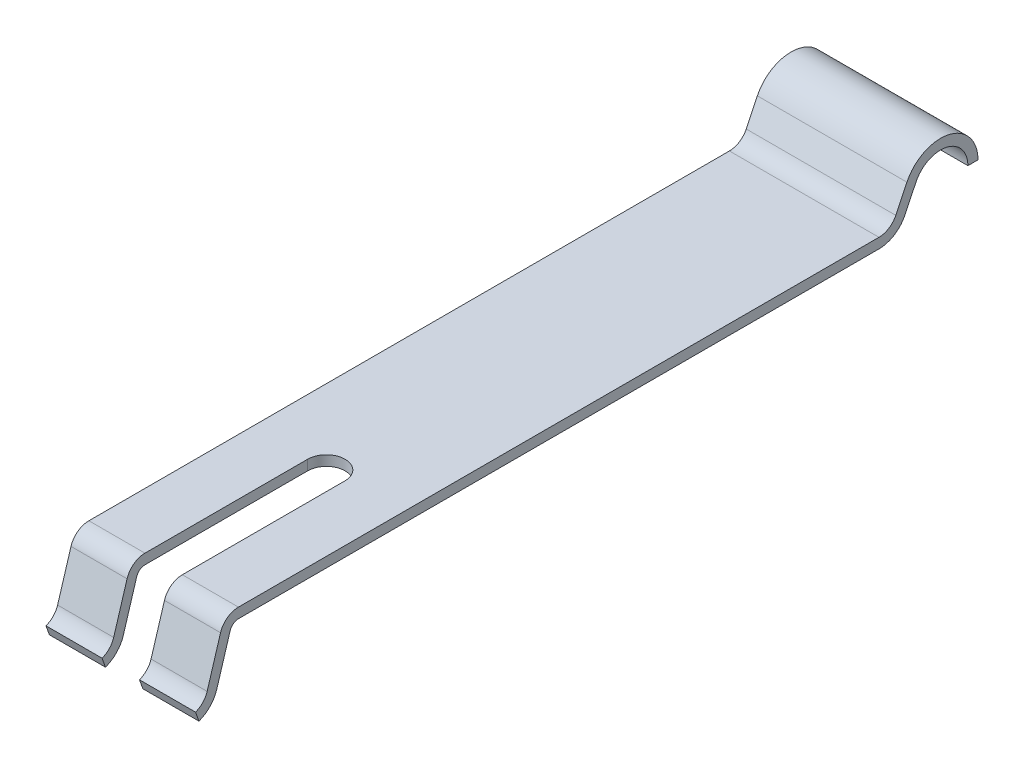
ISO-10303-21;
HEADER;
FILE_DESCRIPTION(('STEP AP214'),'2;1');
FILE_NAME('part.step','',(''),(''),'','','');
FILE_SCHEMA(('AUTOMOTIVE_DESIGN { 1 0 10303 214 1 1 1 1 }'));
ENDSEC;
DATA;
#1=APPLICATION_CONTEXT('core data for automotive mechanical design processes');
#2=APPLICATION_PROTOCOL_DEFINITION('international standard','automotive_design',2000,#1);
#3=PRODUCT_CONTEXT('',#1,'mechanical');
#4=PRODUCT('Part','Part','',(#3));
#5=PRODUCT_RELATED_PRODUCT_CATEGORY('part','',(#4));
#6=PRODUCT_DEFINITION_FORMATION('','',#4);
#7=PRODUCT_DEFINITION_CONTEXT('part definition',#1,'design');
#8=PRODUCT_DEFINITION('design','',#6,#7);
#9=PRODUCT_DEFINITION_SHAPE('','',#8);
#10=(LENGTH_UNIT() NAMED_UNIT(*) SI_UNIT(.MILLI.,.METRE.));
#11=(NAMED_UNIT(*) PLANE_ANGLE_UNIT() SI_UNIT($,.RADIAN.));
#12=(NAMED_UNIT(*) SI_UNIT($,.STERADIAN.) SOLID_ANGLE_UNIT());
#13=UNCERTAINTY_MEASURE_WITH_UNIT(LENGTH_MEASURE(1.E-05),#10,'distance_accuracy_value','');
#14=(GEOMETRIC_REPRESENTATION_CONTEXT(3) GLOBAL_UNCERTAINTY_ASSIGNED_CONTEXT((#13)) GLOBAL_UNIT_ASSIGNED_CONTEXT((#10,
#11,#12)) REPRESENTATION_CONTEXT('',''));
#15=CARTESIAN_POINT('',(0.,0.,0.));
#16=DIRECTION('',(0.,0.,1.));
#17=DIRECTION('',(1.,0.,0.));
#18=AXIS2_PLACEMENT_3D('',#15,#16,#17);
#19=CARTESIAN_POINT('',(4.,-0.499999999999997,9.0351922261174));
#20=DIRECTION('',(-1.,0.,0.));
#21=DIRECTION('',(0.,0.,1.));
#22=AXIS2_PLACEMENT_3D('',#19,#20,#21);
#23=CYLINDRICAL_SURFACE('',#22,0.499999999999997);
#24=DIRECTION('',(-1.,0.,0.));
#25=VECTOR('',#24,1.);
#26=CARTESIAN_POINT('',(4.,0.,9.0351922261174));
#27=LINE('',#26,#25);
#28=CARTESIAN_POINT('',(4.,0.,9.0351922261174));
#29=VERTEX_POINT('',#28);
#30=CARTESIAN_POINT('',(2.5,0.,9.0351922261174));
#31=VERTEX_POINT('',#30);
#32=EDGE_CURVE('E231',#29,#31,#27,.T.);
#33=ORIENTED_EDGE('',*,*,#32,.T.);
#34=CARTESIAN_POINT('',(2.5,-0.499999999999997,9.0351922261174));
#35=DIRECTION('',(1.,0.,0.));
#36=DIRECTION('',(0.,0.,-1.));
#37=AXIS2_PLACEMENT_3D('',#34,#35,#36);
#38=CIRCLE('',#37,0.499999999999997);
#39=CARTESIAN_POINT('',(2.5,-0.354575310744387,9.51357665286529));
#40=VERTEX_POINT('',#39);
#41=EDGE_CURVE('E314',#31,#40,#38,.T.);
#42=ORIENTED_EDGE('',*,*,#41,.T.);
#43=DIRECTION('',(-1.,0.,0.));
#44=VECTOR('',#43,1.);
#45=CARTESIAN_POINT('',(4.,-0.354575310744387,9.51357665286529));
#46=LINE('',#45,#44);
#47=CARTESIAN_POINT('',(4.,-0.354575310744387,9.51357665286529));
#48=VERTEX_POINT('',#47);
#49=EDGE_CURVE('E42',#48,#40,#46,.T.);
#50=ORIENTED_EDGE('',*,*,#49,.F.);
#51=CARTESIAN_POINT('',(4.,-0.499999999999997,9.0351922261174));
#52=DIRECTION('',(1.,0.,0.));
#53=DIRECTION('',(0.,0.,-1.));
#54=AXIS2_PLACEMENT_3D('',#51,#52,#53);
#55=CIRCLE('',#54,0.499999999999997);
#56=EDGE_CURVE('E230',#29,#48,#55,.T.);
#57=ORIENTED_EDGE('',*,*,#56,.F.);
#58=EDGE_LOOP('',(#33,#42,#50,#57));
#59=FACE_BOUND('',#58,.T.);
#60=ADVANCED_FACE('F34',(#59),#23,.T.);
#61=CARTESIAN_POINT('',(4.,-0.354575310744387,9.51357665286529));
#62=DIRECTION('',(0.,-0.290849378511219,-0.956768853495784));
#63=DIRECTION('',(0.,0.956768853495784,-0.290849378511219));
#64=AXIS2_PLACEMENT_3D('',#61,#62,#63);
#65=PLANE('',#64);
#66=ORIENTED_EDGE('',*,*,#49,.T.);
#67=DIRECTION('',(0.,-0.956768853495784,0.290849378511219));
#68=VECTOR('',#67,1.);
#69=CARTESIAN_POINT('',(2.5,-0.354575310744387,9.51357665286529));
#70=LINE('',#69,#68);
#71=CARTESIAN_POINT('',(2.5,-1.53406037853968,9.87212981612726));
#72=VERTEX_POINT('',#71);
#73=EDGE_CURVE('E375',#40,#72,#70,.T.);
#74=ORIENTED_EDGE('',*,*,#73,.T.);
#75=DIRECTION('',(-1.,0.,0.));
#76=VECTOR('',#75,1.);
#77=CARTESIAN_POINT('',(4.,-1.53406037853968,9.87212981612726));
#78=LINE('',#77,#76);
#79=CARTESIAN_POINT('',(4.,-1.53406037853968,9.87212981612726));
#80=VERTEX_POINT('',#79);
#81=EDGE_CURVE('E272',#80,#72,#78,.T.);
#82=ORIENTED_EDGE('',*,*,#81,.F.);
#83=DIRECTION('',(0.,-0.956768853495784,0.290849378511219));
#84=VECTOR('',#83,1.);
#85=CARTESIAN_POINT('',(4.,-0.354575310744387,9.51357665286529));
#86=LINE('',#85,#84);
#87=EDGE_CURVE('E125',#48,#80,#86,.T.);
#88=ORIENTED_EDGE('',*,*,#87,.F.);
#89=EDGE_LOOP('',(#66,#74,#82,#88));
#90=FACE_BOUND('',#89,.T.);
#91=ADVANCED_FACE('F299',(#90),#65,.F.);
#92=CARTESIAN_POINT('',(4.,-1.38863568928381,10.3505142428752));
#93=DIRECTION('',(-1.,0.,0.));
#94=DIRECTION('',(0.,0.,1.));
#95=AXIS2_PLACEMENT_3D('',#92,#93,#94);
#96=CYLINDRICAL_SURFACE('',#95,0.500000000000134);
#97=ORIENTED_EDGE('',*,*,#81,.T.);
#98=CARTESIAN_POINT('',(2.5,-1.38863568928381,10.3505142428752));
#99=DIRECTION('',(1.,0.,0.));
#100=DIRECTION('',(0.,0.,-1.));
#101=AXIS2_PLACEMENT_3D('',#98,#99,#100);
#102=CIRCLE('',#101,0.500000000000134);
#103=CARTESIAN_POINT('',(2.5,-1.85954456376847,10.1824522545144));
#104=VERTEX_POINT('',#103);
#105=EDGE_CURVE('E374',#72,#104,#102,.F.);
#106=ORIENTED_EDGE('',*,*,#105,.T.);
#107=DIRECTION('',(-1.,0.,0.));
#108=VECTOR('',#107,1.);
#109=CARTESIAN_POINT('',(4.,-1.85954456376847,10.1824522545144));
#110=LINE('',#109,#108);
#111=CARTESIAN_POINT('',(4.,-1.85954456376847,10.1824522545144));
#112=VERTEX_POINT('',#111);
#113=EDGE_CURVE('E268',#112,#104,#110,.T.);
#114=ORIENTED_EDGE('',*,*,#113,.F.);
#115=CARTESIAN_POINT('',(4.,-1.38863568928381,10.3505142428752));
#116=DIRECTION('',(-1.,0.,0.));
#117=DIRECTION('',(0.,0.,-1.));
#118=AXIS2_PLACEMENT_3D('',#115,#116,#117);
#119=CIRCLE('',#118,0.500000000000134);
#120=EDGE_CURVE('E386',#80,#112,#119,.T.);
#121=ORIENTED_EDGE('',*,*,#120,.F.);
#122=EDGE_LOOP('',(#97,#106,#114,#121));
#123=FACE_BOUND('',#122,.T.);
#124=ADVANCED_FACE('F309',(#123),#96,.F.);
#125=CARTESIAN_POINT('',(4.,-2.11383535599007,10.0916987807995));
#126=DIRECTION('',(0.,0.336123976721736,-0.941817748968858));
#127=DIRECTION('',(0.,0.941817748968858,0.336123976721736));
#128=AXIS2_PLACEMENT_3D('',#125,#126,#127);
#129=PLANE('',#128);
#130=ORIENTED_EDGE('',*,*,#113,.T.);
#131=DIRECTION('',(0.,-0.941817748968858,-0.336123976721736));
#132=VECTOR('',#131,1.);
#133=CARTESIAN_POINT('',(2.5,-2.11383535599007,10.0916987807995));
#134=LINE('',#133,#132);
#135=CARTESIAN_POINT('',(2.5,-2.11383535599007,10.0916987807995));
#136=VERTEX_POINT('',#135);
#137=EDGE_CURVE('E378',#104,#136,#134,.T.);
#138=ORIENTED_EDGE('',*,*,#137,.T.);
#139=DIRECTION('',(-1.,0.,0.));
#140=VECTOR('',#139,1.);
#141=CARTESIAN_POINT('',(4.,-2.11383535599007,10.0916987807995));
#142=LINE('',#141,#140);
#143=CARTESIAN_POINT('',(4.,-2.11383535599007,10.0916987807995));
#144=VERTEX_POINT('',#143);
#145=EDGE_CURVE('E264',#144,#136,#142,.T.);
#146=ORIENTED_EDGE('',*,*,#145,.F.);
#147=DIRECTION('',(0.,-0.941817748968858,-0.336123976721736));
#148=VECTOR('',#147,1.);
#149=CARTESIAN_POINT('',(4.,-2.11383535599007,10.0916987807995));
#150=LINE('',#149,#148);
#151=EDGE_CURVE('E388',#112,#144,#150,.T.);
#152=ORIENTED_EDGE('',*,*,#151,.F.);
#153=EDGE_LOOP('',(#130,#138,#146,#152));
#154=FACE_BOUND('',#153,.T.);
#155=ADVANCED_FACE('F457',(#154),#129,.F.);
#156=CARTESIAN_POINT('',(4.,-1.38863568928404,10.3505142428752));
#157=DIRECTION('',(-1.,0.,0.));
#158=DIRECTION('',(0.,0.,1.));
#159=AXIS2_PLACEMENT_3D('',#156,#157,#158);
#160=CYLINDRICAL_SURFACE('',#159,0.770000000000012);
#161=ORIENTED_EDGE('',*,*,#145,.T.);
#162=CARTESIAN_POINT('',(2.5,-1.38863568928404,10.3505142428752));
#163=DIRECTION('',(1.,0.,0.));
#164=DIRECTION('',(0.,0.,-1.));
#165=AXIS2_PLACEMENT_3D('',#162,#163,#164);
#166=CIRCLE('',#165,0.770000000000012);
#167=CARTESIAN_POINT('',(2.5,-1.61258971073768,9.61380222568346));
#168=VERTEX_POINT('',#167);
#169=EDGE_CURVE('E452',#136,#168,#166,.T.);
#170=ORIENTED_EDGE('',*,*,#169,.T.);
#171=DIRECTION('',(-1.,0.,0.));
#172=VECTOR('',#171,1.);
#173=CARTESIAN_POINT('',(4.,-1.61258971073768,9.61380222568346));
#174=LINE('',#173,#172);
#175=CARTESIAN_POINT('',(4.,-1.61258971073768,9.61380222568346));
#176=VERTEX_POINT('',#175);
#177=EDGE_CURVE('E260',#176,#168,#174,.T.);
#178=ORIENTED_EDGE('',*,*,#177,.F.);
#179=CARTESIAN_POINT('',(4.,-1.38863568928404,10.3505142428752));
#180=DIRECTION('',(1.,0.,0.));
#181=DIRECTION('',(0.,0.,-1.));
#182=AXIS2_PLACEMENT_3D('',#179,#180,#181);
#183=CIRCLE('',#182,0.770000000000012);
#184=EDGE_CURVE('E390',#144,#176,#183,.T.);
#185=ORIENTED_EDGE('',*,*,#184,.F.);
#186=EDGE_LOOP('',(#161,#170,#178,#185));
#187=FACE_BOUND('',#186,.T.);
#188=ADVANCED_FACE('F462',(#187),#160,.T.);
#189=CARTESIAN_POINT('',(4.,-0.433104642942421,9.25524906242141));
#190=DIRECTION('',(0.,0.290849378511219,0.956768853495784));
#191=DIRECTION('',(0.,-0.956768853495784,0.290849378511219));
#192=AXIS2_PLACEMENT_3D('',#189,#190,#191);
#193=PLANE('',#192);
#194=ORIENTED_EDGE('',*,*,#177,.T.);
#195=DIRECTION('',(0.,0.956768853495784,-0.290849378511219));
#196=VECTOR('',#195,1.);
#197=CARTESIAN_POINT('',(2.5,-0.433104642942421,9.25524906242141));
#198=LINE('',#197,#196);
#199=CARTESIAN_POINT('',(2.5,-0.433104642942421,9.25524906242141));
#200=VERTEX_POINT('',#199);
#201=EDGE_CURVE('E449',#168,#200,#198,.T.);
#202=ORIENTED_EDGE('',*,*,#201,.T.);
#203=DIRECTION('',(-1.,0.,0.));
#204=VECTOR('',#203,1.);
#205=CARTESIAN_POINT('',(4.,-0.433104642942421,9.25524906242141));
#206=LINE('',#205,#204);
#207=CARTESIAN_POINT('',(4.,-0.433104642942421,9.25524906242141));
#208=VERTEX_POINT('',#207);
#209=EDGE_CURVE('E256',#208,#200,#206,.T.);
#210=ORIENTED_EDGE('',*,*,#209,.F.);
#211=DIRECTION('',(0.,0.956768853495784,-0.290849378511219));
#212=VECTOR('',#211,1.);
#213=CARTESIAN_POINT('',(4.,-0.433104642942421,9.25524906242141));
#214=LINE('',#213,#212);
#215=EDGE_CURVE('E392',#176,#208,#214,.T.);
#216=ORIENTED_EDGE('',*,*,#215,.F.);
#217=EDGE_LOOP('',(#194,#202,#210,#216));
#218=FACE_BOUND('',#217,.T.);
#219=ADVANCED_FACE('F300',(#218),#193,.F.);
#220=CARTESIAN_POINT('',(4.,-0.499999999999997,9.0351922261174));
#221=DIRECTION('',(-1.,0.,0.));
#222=DIRECTION('',(0.,0.,1.));
#223=AXIS2_PLACEMENT_3D('',#220,#221,#222);
#224=CYLINDRICAL_SURFACE('',#223,0.229999999999984);
#225=ORIENTED_EDGE('',*,*,#209,.T.);
#226=CARTESIAN_POINT('',(2.5,-0.499999999999997,9.0351922261174));
#227=DIRECTION('',(1.,0.,0.));
#228=DIRECTION('',(0.,0.,-1.));
#229=AXIS2_PLACEMENT_3D('',#226,#227,#228);
#230=CIRCLE('',#229,0.229999999999984);
#231=CARTESIAN_POINT('',(2.5,-0.270000000000012,9.0351922261174));
#232=VERTEX_POINT('',#231);
#233=EDGE_CURVE('E446',#200,#232,#230,.F.);
#234=ORIENTED_EDGE('',*,*,#233,.T.);
#235=DIRECTION('',(-1.,0.,0.));
#236=VECTOR('',#235,1.);
#237=CARTESIAN_POINT('',(4.,-0.270000000000012,9.0351922261174));
#238=LINE('',#237,#236);
#239=CARTESIAN_POINT('',(4.,-0.270000000000012,9.0351922261174));
#240=VERTEX_POINT('',#239);
#241=EDGE_CURVE('E252',#240,#232,#238,.T.);
#242=ORIENTED_EDGE('',*,*,#241,.F.);
#243=CARTESIAN_POINT('',(4.,-0.499999999999997,9.0351922261174));
#244=DIRECTION('',(-1.,0.,0.));
#245=DIRECTION('',(0.,0.,-1.));
#246=AXIS2_PLACEMENT_3D('',#243,#244,#245);
#247=CIRCLE('',#246,0.229999999999984);
#248=EDGE_CURVE('E394',#208,#240,#247,.T.);
#249=ORIENTED_EDGE('',*,*,#248,.F.);
#250=EDGE_LOOP('',(#225,#234,#242,#249));
#251=FACE_BOUND('',#250,.T.);
#252=ADVANCED_FACE('F293',(#251),#224,.F.);
#253=CARTESIAN_POINT('',(1.5,-0.354575310744387,9.51357665286529));
#254=VERTEX_POINT('',#253);
#255=CARTESIAN_POINT('',(0.,-0.354575310744387,9.51357665286529));
#256=VERTEX_POINT('',#255);
#257=EDGE_CURVE('E274',#254,#256,#46,.T.);
#258=ORIENTED_EDGE('',*,*,#257,.F.);
#259=CARTESIAN_POINT('',(1.5,-0.499999999999997,9.0351922261174));
#260=DIRECTION('',(-1.,0.,0.));
#261=DIRECTION('',(0.,0.,1.));
#262=AXIS2_PLACEMENT_3D('',#259,#260,#261);
#263=CIRCLE('',#262,0.499999999999997);
#264=CARTESIAN_POINT('',(1.5,0.,9.0351922261174));
#265=VERTEX_POINT('',#264);
#266=EDGE_CURVE('E442',#254,#265,#263,.T.);
#267=ORIENTED_EDGE('',*,*,#266,.T.);
#268=CARTESIAN_POINT('',(0.,0.,9.0351922261174));
#269=VERTEX_POINT('',#268);
#270=EDGE_CURVE('E116',#265,#269,#27,.T.);
#271=ORIENTED_EDGE('',*,*,#270,.T.);
#272=CARTESIAN_POINT('',(0.,-0.499999999999997,9.0351922261174));
#273=DIRECTION('',(1.,0.,0.));
#274=DIRECTION('',(0.,0.,-1.));
#275=AXIS2_PLACEMENT_3D('',#272,#273,#274);
#276=CIRCLE('',#275,0.499999999999997);
#277=EDGE_CURVE('E192',#269,#256,#276,.T.);
#278=ORIENTED_EDGE('',*,*,#277,.T.);
#279=EDGE_LOOP('',(#258,#267,#271,#278));
#280=FACE_BOUND('',#279,.T.);
#281=ADVANCED_FACE('F36',(#280),#23,.T.);
#282=CARTESIAN_POINT('',(1.5,-1.53406037853968,9.87212981612726));
#283=VERTEX_POINT('',#282);
#284=CARTESIAN_POINT('',(0.,-1.53406037853968,9.87212981612726));
#285=VERTEX_POINT('',#284);
#286=EDGE_CURVE('E271',#283,#285,#78,.T.);
#287=ORIENTED_EDGE('',*,*,#286,.F.);
#288=DIRECTION('',(0.,0.956768853495784,-0.290849378511219));
#289=VECTOR('',#288,1.);
#290=CARTESIAN_POINT('',(1.5,-0.354575310744387,9.51357665286529));
#291=LINE('',#290,#289);
#292=EDGE_CURVE('E286',#283,#254,#291,.T.);
#293=ORIENTED_EDGE('',*,*,#292,.T.);
#294=ORIENTED_EDGE('',*,*,#257,.T.);
#295=DIRECTION('',(0.,-0.956768853495784,0.290849378511219));
#296=VECTOR('',#295,1.);
#297=CARTESIAN_POINT('',(0.,-0.354575310744387,9.51357665286529));
#298=LINE('',#297,#296);
#299=EDGE_CURVE('E194',#256,#285,#298,.T.);
#300=ORIENTED_EDGE('',*,*,#299,.T.);
#301=EDGE_LOOP('',(#287,#293,#294,#300));
#302=FACE_BOUND('',#301,.T.);
#303=ADVANCED_FACE('F282',(#302),#65,.F.);
#304=CARTESIAN_POINT('',(1.5,-1.85954456376847,10.1824522545144));
#305=VERTEX_POINT('',#304);
#306=CARTESIAN_POINT('',(0.,-1.85954456376847,10.1824522545144));
#307=VERTEX_POINT('',#306);
#308=EDGE_CURVE('E267',#305,#307,#110,.T.);
#309=ORIENTED_EDGE('',*,*,#308,.F.);
#310=CARTESIAN_POINT('',(1.5,-1.38863568928381,10.3505142428752));
#311=DIRECTION('',(-1.,0.,0.));
#312=DIRECTION('',(0.,0.,1.));
#313=AXIS2_PLACEMENT_3D('',#310,#311,#312);
#314=CIRCLE('',#313,0.500000000000134);
#315=EDGE_CURVE('E438',#305,#283,#314,.F.);
#316=ORIENTED_EDGE('',*,*,#315,.T.);
#317=ORIENTED_EDGE('',*,*,#286,.T.);
#318=CARTESIAN_POINT('',(0.,-1.38863568928381,10.3505142428752));
#319=DIRECTION('',(-1.,0.,0.));
#320=DIRECTION('',(0.,0.,-1.));
#321=AXIS2_PLACEMENT_3D('',#318,#319,#320);
#322=CIRCLE('',#321,0.500000000000134);
#323=EDGE_CURVE('E198',#285,#307,#322,.T.);
#324=ORIENTED_EDGE('',*,*,#323,.T.);
#325=EDGE_LOOP('',(#309,#316,#317,#324));
#326=FACE_BOUND('',#325,.T.);
#327=ADVANCED_FACE('F298',(#326),#96,.F.);
#328=CARTESIAN_POINT('',(1.5,-2.11383535599007,10.0916987807995));
#329=VERTEX_POINT('',#328);
#330=CARTESIAN_POINT('',(0.,-2.11383535599007,10.0916987807995));
#331=VERTEX_POINT('',#330);
#332=EDGE_CURVE('E263',#329,#331,#142,.T.);
#333=ORIENTED_EDGE('',*,*,#332,.F.);
#334=DIRECTION('',(0.,0.941817748968858,0.336123976721736));
#335=VECTOR('',#334,1.);
#336=CARTESIAN_POINT('',(1.5,-2.11383535599007,10.0916987807995));
#337=LINE('',#336,#335);
#338=EDGE_CURVE('E435',#329,#305,#337,.T.);
#339=ORIENTED_EDGE('',*,*,#338,.T.);
#340=ORIENTED_EDGE('',*,*,#308,.T.);
#341=DIRECTION('',(0.,-0.941817748968858,-0.336123976721736));
#342=VECTOR('',#341,1.);
#343=CARTESIAN_POINT('',(0.,-2.11383535599007,10.0916987807995));
#344=LINE('',#343,#342);
#345=EDGE_CURVE('E201',#307,#331,#344,.T.);
#346=ORIENTED_EDGE('',*,*,#345,.T.);
#347=EDGE_LOOP('',(#333,#339,#340,#346));
#348=FACE_BOUND('',#347,.T.);
#349=ADVANCED_FACE('F474',(#348),#129,.F.);
#350=CARTESIAN_POINT('',(1.5,-1.61258971073768,9.61380222568346));
#351=VERTEX_POINT('',#350);
#352=CARTESIAN_POINT('',(0.,-1.61258971073768,9.61380222568346));
#353=VERTEX_POINT('',#352);
#354=EDGE_CURVE('E259',#351,#353,#174,.T.);
#355=ORIENTED_EDGE('',*,*,#354,.F.);
#356=CARTESIAN_POINT('',(1.5,-1.38863568928404,10.3505142428752));
#357=DIRECTION('',(-1.,0.,0.));
#358=DIRECTION('',(0.,0.,1.));
#359=AXIS2_PLACEMENT_3D('',#356,#357,#358);
#360=CIRCLE('',#359,0.770000000000012);
#361=EDGE_CURVE('E432',#351,#329,#360,.T.);
#362=ORIENTED_EDGE('',*,*,#361,.T.);
#363=ORIENTED_EDGE('',*,*,#332,.T.);
#364=CARTESIAN_POINT('',(0.,-1.38863568928404,10.3505142428752));
#365=DIRECTION('',(1.,0.,0.));
#366=DIRECTION('',(0.,0.,-1.));
#367=AXIS2_PLACEMENT_3D('',#364,#365,#366);
#368=CIRCLE('',#367,0.770000000000012);
#369=EDGE_CURVE('E204',#331,#353,#368,.T.);
#370=ORIENTED_EDGE('',*,*,#369,.T.);
#371=EDGE_LOOP('',(#355,#362,#363,#370));
#372=FACE_BOUND('',#371,.T.);
#373=ADVANCED_FACE('F480',(#372),#160,.T.);
#374=CARTESIAN_POINT('',(1.5,-0.433104642942421,9.25524906242141));
#375=VERTEX_POINT('',#374);
#376=CARTESIAN_POINT('',(0.,-0.433104642942421,9.25524906242141));
#377=VERTEX_POINT('',#376);
#378=EDGE_CURVE('E255',#375,#377,#206,.T.);
#379=ORIENTED_EDGE('',*,*,#378,.F.);
#380=DIRECTION('',(0.,-0.956768853495784,0.290849378511219));
#381=VECTOR('',#380,1.);
#382=CARTESIAN_POINT('',(1.5,-0.433104642942421,9.25524906242141));
#383=LINE('',#382,#381);
#384=EDGE_CURVE('E429',#375,#351,#383,.T.);
#385=ORIENTED_EDGE('',*,*,#384,.T.);
#386=ORIENTED_EDGE('',*,*,#354,.T.);
#387=DIRECTION('',(0.,0.956768853495784,-0.290849378511219));
#388=VECTOR('',#387,1.);
#389=CARTESIAN_POINT('',(0.,-0.433104642942421,9.25524906242141));
#390=LINE('',#389,#388);
#391=EDGE_CURVE('E207',#353,#377,#390,.T.);
#392=ORIENTED_EDGE('',*,*,#391,.T.);
#393=EDGE_LOOP('',(#379,#385,#386,#392));
#394=FACE_BOUND('',#393,.T.);
#395=ADVANCED_FACE('F491',(#394),#193,.F.);
#396=CARTESIAN_POINT('',(1.5,-0.270000000000012,9.0351922261174));
#397=VERTEX_POINT('',#396);
#398=CARTESIAN_POINT('',(0.,-0.270000000000012,9.0351922261174));
#399=VERTEX_POINT('',#398);
#400=EDGE_CURVE('E251',#397,#399,#238,.T.);
#401=ORIENTED_EDGE('',*,*,#400,.F.);
#402=CARTESIAN_POINT('',(1.5,-0.499999999999997,9.0351922261174));
#403=DIRECTION('',(-1.,0.,0.));
#404=DIRECTION('',(0.,0.,1.));
#405=AXIS2_PLACEMENT_3D('',#402,#403,#404);
#406=CIRCLE('',#405,0.229999999999984);
#407=EDGE_CURVE('E426',#397,#375,#406,.F.);
#408=ORIENTED_EDGE('',*,*,#407,.T.);
#409=ORIENTED_EDGE('',*,*,#378,.T.);
#410=CARTESIAN_POINT('',(0.,-0.499999999999997,9.0351922261174));
#411=DIRECTION('',(-1.,0.,0.));
#412=DIRECTION('',(0.,0.,-1.));
#413=AXIS2_PLACEMENT_3D('',#410,#411,#412);
#414=CIRCLE('',#413,0.229999999999984);
#415=EDGE_CURVE('E210',#377,#399,#414,.T.);
#416=ORIENTED_EDGE('',*,*,#415,.T.);
#417=EDGE_LOOP('',(#401,#408,#409,#416));
#418=FACE_BOUND('',#417,.T.);
#419=ADVANCED_FACE('F303',(#418),#224,.F.);
#420=CARTESIAN_POINT('',(4.,-0.270000000000012,9.0351922261174));
#421=DIRECTION('',(0.,1.,0.));
#422=DIRECTION('',(0.,0.,1.));
#423=AXIS2_PLACEMENT_3D('',#420,#421,#422);
#424=PLANE('',#423);
#425=ORIENTED_EDGE('',*,*,#241,.T.);
#426=DIRECTION('',(0.,0.,-1.));
#427=VECTOR('',#426,1.);
#428=CARTESIAN_POINT('',(2.5,-0.270000000000012,9.0351922261174));
#429=LINE('',#428,#427);
#430=CARTESIAN_POINT('',(2.5,-0.270000000000013,4.68245225451435));
#431=VERTEX_POINT('',#430);
#432=EDGE_CURVE('E444',#232,#431,#429,.T.);
#433=ORIENTED_EDGE('',*,*,#432,.T.);
#434=CARTESIAN_POINT('',(2.,-0.270000000000013,4.68245225451435));
#435=DIRECTION('',(0.,1.,0.));
#436=DIRECTION('',(0.,0.,1.));
#437=AXIS2_PLACEMENT_3D('',#434,#435,#436);
#438=CIRCLE('',#437,0.5);
#439=CARTESIAN_POINT('',(1.5,-0.270000000000013,4.68245225451435));
#440=VERTEX_POINT('',#439);
#441=EDGE_CURVE('E195',#431,#440,#438,.T.);
#442=ORIENTED_EDGE('',*,*,#441,.T.);
#443=DIRECTION('',(0.,0.,1.));
#444=VECTOR('',#443,1.);
#445=CARTESIAN_POINT('',(1.5,-0.270000000000012,9.0351922261174));
#446=LINE('',#445,#444);
#447=EDGE_CURVE('E422',#440,#397,#446,.T.);
#448=ORIENTED_EDGE('',*,*,#447,.T.);
#449=ORIENTED_EDGE('',*,*,#400,.T.);
#450=DIRECTION('',(0.,0.,-1.));
#451=VECTOR('',#450,1.);
#452=CARTESIAN_POINT('',(0.,-0.270000000000012,9.0351922261174));
#453=LINE('',#452,#451);
#454=CARTESIAN_POINT('',(0.,-0.270000000000016,-8.09786088611592));
#455=VERTEX_POINT('',#454);
#456=EDGE_CURVE('E213',#399,#455,#453,.T.);
#457=ORIENTED_EDGE('',*,*,#456,.T.);
#458=DIRECTION('',(-1.,0.,0.));
#459=VECTOR('',#458,1.);
#460=CARTESIAN_POINT('',(4.,-0.270000000000016,-8.09786088611592));
#461=LINE('',#460,#459);
#462=CARTESIAN_POINT('',(4.,-0.270000000000016,-8.09786088611592));
#463=VERTEX_POINT('',#462);
#464=EDGE_CURVE('E248',#463,#455,#461,.T.);
#465=ORIENTED_EDGE('',*,*,#464,.F.);
#466=DIRECTION('',(0.,0.,-1.));
#467=VECTOR('',#466,1.);
#468=CARTESIAN_POINT('',(4.,-0.270000000000012,9.0351922261174));
#469=LINE('',#468,#467);
#470=EDGE_CURVE('E396',#240,#463,#469,.T.);
#471=ORIENTED_EDGE('',*,*,#470,.F.);
#472=EDGE_LOOP('',(#425,#433,#442,#448,#449,#457,#465,#471));
#473=FACE_BOUND('',#472,.T.);
#474=ADVANCED_FACE('F497',(#473),#424,.F.);
#475=CARTESIAN_POINT('',(4.,0.499999999999997,-8.09786088611592));
#476=DIRECTION('',(-1.,0.,0.));
#477=DIRECTION('',(0.,0.,1.));
#478=AXIS2_PLACEMENT_3D('',#475,#476,#477);
#479=CYLINDRICAL_SURFACE('',#478,0.770000000000013);
#480=CARTESIAN_POINT('',(0.,0.499999999999997,-8.09786088611592));
#481=DIRECTION('',(1.,0.,0.));
#482=DIRECTION('',(0.,0.,-1.));
#483=AXIS2_PLACEMENT_3D('',#480,#481,#482);
#484=CIRCLE('',#483,0.770000000000013);
#485=CARTESIAN_POINT('',(0.,0.166310550525428,-8.79179989734773));
#486=VERTEX_POINT('',#485);
#487=EDGE_CURVE('E215',#455,#486,#484,.T.);
#488=ORIENTED_EDGE('',*,*,#487,.T.);
#489=DIRECTION('',(-1.,0.,0.));
#490=VECTOR('',#489,1.);
#491=CARTESIAN_POINT('',(4.,0.166310550525428,-8.79179989734773));
#492=LINE('',#491,#490);
#493=CARTESIAN_POINT('',(4.,0.166310550525428,-8.79179989734773));
#494=VERTEX_POINT('',#493);
#495=EDGE_CURVE('E245',#494,#486,#492,.T.);
#496=ORIENTED_EDGE('',*,*,#495,.F.);
#497=CARTESIAN_POINT('',(4.,0.499999999999997,-8.09786088611592));
#498=DIRECTION('',(1.,0.,0.));
#499=DIRECTION('',(0.,0.,-1.));
#500=AXIS2_PLACEMENT_3D('',#497,#498,#499);
#501=CIRCLE('',#500,0.770000000000013);
#502=EDGE_CURVE('E398',#463,#494,#501,.T.);
#503=ORIENTED_EDGE('',*,*,#502,.F.);
#504=ORIENTED_EDGE('',*,*,#464,.T.);
#505=EDGE_LOOP('',(#488,#496,#503,#504));
#506=FACE_BOUND('',#505,.T.);
#507=ADVANCED_FACE('F529',(#506),#479,.T.);
#508=CARTESIAN_POINT('',(4.,0.166310550525428,-8.79179989734773));
#509=DIRECTION('',(0.,0.433362921395535,0.901219495106229));
#510=DIRECTION('',(0.,-0.90121949510623,0.433362921395535));
#511=AXIS2_PLACEMENT_3D('',#508,#509,#510);
#512=PLANE('',#511);
#513=DIRECTION('',(0.,0.901219495106229,-0.433362921395535));
#514=VECTOR('',#513,1.);
#515=CARTESIAN_POINT('',(0.,0.166310550525428,-8.79179989734773));
#516=LINE('',#515,#514);
#517=CARTESIAN_POINT('',(0.,0.785534458083913,-9.08956163356701));
#518=VERTEX_POINT('',#517);
#519=EDGE_CURVE('E217',#486,#518,#516,.T.);
#520=ORIENTED_EDGE('',*,*,#519,.T.);
#521=DIRECTION('',(-1.,0.,0.));
#522=VECTOR('',#521,1.);
#523=CARTESIAN_POINT('',(4.,0.785534458083913,-9.08956163356701));
#524=LINE('',#523,#522);
#525=CARTESIAN_POINT('',(4.,0.785534458083913,-9.08956163356701));
#526=VERTEX_POINT('',#525);
#527=EDGE_CURVE('E242',#526,#518,#524,.T.);
#528=ORIENTED_EDGE('',*,*,#527,.F.);
#529=DIRECTION('',(0.,0.901219495106229,-0.433362921395535));
#530=VECTOR('',#529,1.);
#531=CARTESIAN_POINT('',(4.,0.166310550525428,-8.79179989734773));
#532=LINE('',#531,#530);
#533=EDGE_CURVE('E400',#494,#526,#532,.T.);
#534=ORIENTED_EDGE('',*,*,#533,.F.);
#535=ORIENTED_EDGE('',*,*,#495,.T.);
#536=EDGE_LOOP('',(#520,#528,#534,#535));
#537=FACE_BOUND('',#536,.T.);
#538=ADVANCED_FACE('F525',(#537),#512,.F.);
#539=CARTESIAN_POINT('',(4.,0.469179525465173,-9.74745186499455));
#540=DIRECTION('',(-1.,0.,0.));
#541=DIRECTION('',(0.,0.,1.));
#542=AXIS2_PLACEMENT_3D('',#539,#540,#541);
#543=CYLINDRICAL_SURFACE('',#542,0.729999999999995);
#544=CARTESIAN_POINT('',(0.,0.469179525465173,-9.74745186499455));
#545=DIRECTION('',(-1.,0.,0.));
#546=DIRECTION('',(0.,0.,-1.));
#547=AXIS2_PLACEMENT_3D('',#544,#545,#546);
#548=CIRCLE('',#547,0.729999999999995);
#549=CARTESIAN_POINT('',(0.,0.469179525465175,-10.4774518649946));
#550=VERTEX_POINT('',#549);
#551=EDGE_CURVE('E219',#518,#550,#548,.T.);
#552=ORIENTED_EDGE('',*,*,#551,.T.);
#553=DIRECTION('',(-1.,0.,0.));
#554=VECTOR('',#553,1.);
#555=CARTESIAN_POINT('',(4.,0.469179525465175,-10.4774518649946));
#556=LINE('',#555,#554);
#557=CARTESIAN_POINT('',(4.,0.469179525465175,-10.4774518649946));
#558=VERTEX_POINT('',#557);
#559=EDGE_CURVE('E239',#558,#550,#556,.T.);
#560=ORIENTED_EDGE('',*,*,#559,.F.);
#561=CARTESIAN_POINT('',(4.,0.469179525465173,-9.74745186499455));
#562=DIRECTION('',(-1.,0.,0.));
#563=DIRECTION('',(0.,0.,-1.));
#564=AXIS2_PLACEMENT_3D('',#561,#562,#563);
#565=CIRCLE('',#564,0.729999999999995);
#566=EDGE_CURVE('E402',#526,#558,#565,.T.);
#567=ORIENTED_EDGE('',*,*,#566,.F.);
#568=ORIENTED_EDGE('',*,*,#527,.T.);
#569=EDGE_LOOP('',(#552,#560,#567,#568));
#570=FACE_BOUND('',#569,.T.);
#571=ADVANCED_FACE('F522',(#570),#543,.F.);
#572=CARTESIAN_POINT('',(4.,0.469179525465175,-10.4774518649946));
#573=DIRECTION('',(0.,1.,0.));
#574=DIRECTION('',(0.,0.,1.));
#575=AXIS2_PLACEMENT_3D('',#572,#573,#574);
#576=PLANE('',#575);
#577=DIRECTION('',(0.,0.,-1.));
#578=VECTOR('',#577,1.);
#579=CARTESIAN_POINT('',(0.,0.469179525465175,-10.4774518649946));
#580=LINE('',#579,#578);
#581=CARTESIAN_POINT('',(0.,0.469179525465175,-10.7474518649946));
#582=VERTEX_POINT('',#581);
#583=EDGE_CURVE('E221',#550,#582,#580,.T.);
#584=ORIENTED_EDGE('',*,*,#583,.T.);
#585=DIRECTION('',(-1.,0.,0.));
#586=VECTOR('',#585,1.);
#587=CARTESIAN_POINT('',(4.,0.469179525465175,-10.7474518649946));
#588=LINE('',#587,#586);
#589=CARTESIAN_POINT('',(4.,0.469179525465175,-10.7474518649946));
#590=VERTEX_POINT('',#589);
#591=EDGE_CURVE('E236',#590,#582,#588,.T.);
#592=ORIENTED_EDGE('',*,*,#591,.F.);
#593=DIRECTION('',(0.,0.,-1.));
#594=VECTOR('',#593,1.);
#595=CARTESIAN_POINT('',(4.,0.469179525465175,-10.4774518649946));
#596=LINE('',#595,#594);
#597=EDGE_CURVE('E404',#558,#590,#596,.T.);
#598=ORIENTED_EDGE('',*,*,#597,.F.);
#599=ORIENTED_EDGE('',*,*,#559,.T.);
#600=EDGE_LOOP('',(#584,#592,#598,#599));
#601=FACE_BOUND('',#600,.T.);
#602=ADVANCED_FACE('F410',(#601),#576,.F.);
#603=CARTESIAN_POINT('',(4.,0.469179525465175,-9.74745186499456));
#604=DIRECTION('',(-1.,0.,0.));
#605=DIRECTION('',(0.,0.,1.));
#606=AXIS2_PLACEMENT_3D('',#603,#604,#605);
#607=CYLINDRICAL_SURFACE('',#606,1.);
#608=CARTESIAN_POINT('',(0.,0.469179525465175,-9.74745186499456));
#609=DIRECTION('',(1.,0.,0.));
#610=DIRECTION('',(0.,0.,-1.));
#611=AXIS2_PLACEMENT_3D('',#608,#609,#610);
#612=CIRCLE('',#611,1.);
#613=CARTESIAN_POINT('',(0.,0.90254244686071,-8.84623236988832));
#614=VERTEX_POINT('',#613);
#615=EDGE_CURVE('E223',#582,#614,#612,.T.);
#616=ORIENTED_EDGE('',*,*,#615,.T.);
#617=DIRECTION('',(-1.,0.,0.));
#618=VECTOR('',#617,1.);
#619=CARTESIAN_POINT('',(4.,0.90254244686071,-8.84623236988832));
#620=LINE('',#619,#618);
#621=CARTESIAN_POINT('',(4.,0.90254244686071,-8.84623236988832));
#622=VERTEX_POINT('',#621);
#623=EDGE_CURVE('E183',#622,#614,#620,.T.);
#624=ORIENTED_EDGE('',*,*,#623,.F.);
#625=CARTESIAN_POINT('',(4.,0.469179525465175,-9.74745186499456));
#626=DIRECTION('',(1.,0.,0.));
#627=DIRECTION('',(0.,0.,-1.));
#628=AXIS2_PLACEMENT_3D('',#625,#626,#627);
#629=CIRCLE('',#628,1.);
#630=EDGE_CURVE('E171',#590,#622,#629,.T.);
#631=ORIENTED_EDGE('',*,*,#630,.F.);
#632=ORIENTED_EDGE('',*,*,#591,.T.);
#633=EDGE_LOOP('',(#616,#624,#631,#632));
#634=FACE_BOUND('',#633,.T.);
#635=ADVANCED_FACE('F414',(#634),#607,.T.);
#636=CARTESIAN_POINT('',(4.,0.283318539302229,-8.54847063366904));
#637=DIRECTION('',(0.,-0.433362921395537,-0.901219495106228));
#638=DIRECTION('',(0.,0.901219495106229,-0.433362921395537));
#639=AXIS2_PLACEMENT_3D('',#636,#637,#638);
#640=PLANE('',#639);
#641=DIRECTION('',(0.,-0.901219495106228,0.433362921395537));
#642=VECTOR('',#641,1.);
#643=CARTESIAN_POINT('',(0.,0.283318539302229,-8.54847063366904));
#644=LINE('',#643,#642);
#645=CARTESIAN_POINT('',(0.,0.283318539302228,-8.54847063366904));
#646=VERTEX_POINT('',#645);
#647=EDGE_CURVE('E180',#614,#646,#644,.T.);
#648=ORIENTED_EDGE('',*,*,#647,.T.);
#649=DIRECTION('',(-1.,0.,0.));
#650=VECTOR('',#649,1.);
#651=CARTESIAN_POINT('',(4.,0.283318539302228,-8.54847063366904));
#652=LINE('',#651,#650);
#653=CARTESIAN_POINT('',(4.,0.283318539302228,-8.54847063366904));
#654=VERTEX_POINT('',#653);
#655=EDGE_CURVE('E177',#654,#646,#652,.T.);
#656=ORIENTED_EDGE('',*,*,#655,.F.);
#657=DIRECTION('',(0.,-0.901219495106228,0.433362921395537));
#658=VECTOR('',#657,1.);
#659=CARTESIAN_POINT('',(4.,0.283318539302229,-8.54847063366904));
#660=LINE('',#659,#658);
#661=EDGE_CURVE('E164',#622,#654,#660,.T.);
#662=ORIENTED_EDGE('',*,*,#661,.F.);
#663=ORIENTED_EDGE('',*,*,#623,.T.);
#664=EDGE_LOOP('',(#648,#656,#662,#663));
#665=FACE_BOUND('',#664,.T.);
#666=ADVANCED_FACE('F178',(#665),#640,.F.);
#667=CARTESIAN_POINT('',(4.,0.5,-8.09786088611593));
#668=DIRECTION('',(-1.,0.,0.));
#669=DIRECTION('',(0.,0.,1.));
#670=AXIS2_PLACEMENT_3D('',#667,#668,#669);
#671=CYLINDRICAL_SURFACE('',#670,0.499999999999998);
#672=CARTESIAN_POINT('',(0.,0.5,-8.09786088611593));
#673=DIRECTION('',(-1.,0.,0.));
#674=DIRECTION('',(0.,0.,-1.));
#675=AXIS2_PLACEMENT_3D('',#672,#673,#674);
#676=CIRCLE('',#675,0.499999999999998);
#677=CARTESIAN_POINT('',(0.,0.,-8.09786088611592));
#678=VERTEX_POINT('',#677);
#679=EDGE_CURVE('E226',#646,#678,#676,.T.);
#680=ORIENTED_EDGE('',*,*,#679,.T.);
#681=DIRECTION('',(-1.,0.,0.));
#682=VECTOR('',#681,1.);
#683=CARTESIAN_POINT('',(4.,0.,-8.09786088611592));
#684=LINE('',#683,#682);
#685=CARTESIAN_POINT('',(4.,0.,-8.09786088611592));
#686=VERTEX_POINT('',#685);
#687=EDGE_CURVE('E184',#686,#678,#684,.T.);
#688=ORIENTED_EDGE('',*,*,#687,.F.);
#689=CARTESIAN_POINT('',(4.,0.5,-8.09786088611593));
#690=DIRECTION('',(-1.,0.,0.));
#691=DIRECTION('',(0.,0.,-1.));
#692=AXIS2_PLACEMENT_3D('',#689,#690,#691);
#693=CIRCLE('',#692,0.499999999999998);
#694=EDGE_CURVE('E168',#654,#686,#693,.T.);
#695=ORIENTED_EDGE('',*,*,#694,.F.);
#696=ORIENTED_EDGE('',*,*,#655,.T.);
#697=EDGE_LOOP('',(#680,#688,#695,#696));
#698=FACE_BOUND('',#697,.T.);
#699=ADVANCED_FACE('F186',(#698),#671,.F.);
#700=CARTESIAN_POINT('',(4.,0.,9.0351922261174));
#701=DIRECTION('',(0.,-1.,0.));
#702=DIRECTION('',(0.,0.,-1.));
#703=AXIS2_PLACEMENT_3D('',#700,#701,#702);
#704=PLANE('',#703);
#705=CARTESIAN_POINT('',(2.,0.,4.68245225451435));
#706=DIRECTION('',(0.,1.,0.));
#707=DIRECTION('',(0.,0.,1.));
#708=AXIS2_PLACEMENT_3D('',#705,#706,#707);
#709=CIRCLE('',#708,0.5);
#710=CARTESIAN_POINT('',(2.5,0.,4.68245225451435));
#711=VERTEX_POINT('',#710);
#712=CARTESIAN_POINT('',(1.5,0.,4.68245225451435));
#713=VERTEX_POINT('',#712);
#714=EDGE_CURVE('E49',#711,#713,#709,.T.);
#715=ORIENTED_EDGE('',*,*,#714,.F.);
#716=DIRECTION('',(0.,0.,1.));
#717=VECTOR('',#716,1.);
#718=CARTESIAN_POINT('',(2.5,0.,9.0351922261174));
#719=LINE('',#718,#717);
#720=EDGE_CURVE('E11',#711,#31,#719,.T.);
#721=ORIENTED_EDGE('',*,*,#720,.T.);
#722=ORIENTED_EDGE('',*,*,#32,.F.);
#723=DIRECTION('',(0.,0.,1.));
#724=VECTOR('',#723,1.);
#725=CARTESIAN_POINT('',(4.,0.,9.0351922261174));
#726=LINE('',#725,#724);
#727=EDGE_CURVE('E58',#686,#29,#726,.T.);
#728=ORIENTED_EDGE('',*,*,#727,.F.);
#729=ORIENTED_EDGE('',*,*,#687,.T.);
#730=DIRECTION('',(0.,0.,1.));
#731=VECTOR('',#730,1.);
#732=CARTESIAN_POINT('',(0.,0.,9.0351922261174));
#733=LINE('',#732,#731);
#734=EDGE_CURVE('E228',#678,#269,#733,.T.);
#735=ORIENTED_EDGE('',*,*,#734,.T.);
#736=ORIENTED_EDGE('',*,*,#270,.F.);
#737=DIRECTION('',(0.,0.,1.));
#738=VECTOR('',#737,1.);
#739=CARTESIAN_POINT('',(1.5,0.,4.68245225451435));
#740=LINE('',#739,#738);
#741=EDGE_CURVE('E415',#713,#265,#740,.T.);
#742=ORIENTED_EDGE('',*,*,#741,.F.);
#743=EDGE_LOOP('',(#715,#721,#722,#728,#729,#735,#736,#742));
#744=FACE_BOUND('',#743,.T.);
#745=ADVANCED_FACE('F318',(#744),#704,.F.);
#746=CARTESIAN_POINT('',(4.,-0.499999999999997,9.0351922261174));
#747=DIRECTION('',(1.,0.,0.));
#748=DIRECTION('',(0.,0.,-1.));
#749=AXIS2_PLACEMENT_3D('',#746,#747,#748);
#750=PLANE('',#749);
#751=ORIENTED_EDGE('',*,*,#56,.T.);
#752=ORIENTED_EDGE('',*,*,#87,.T.);
#753=ORIENTED_EDGE('',*,*,#120,.T.);
#754=ORIENTED_EDGE('',*,*,#151,.T.);
#755=ORIENTED_EDGE('',*,*,#184,.T.);
#756=ORIENTED_EDGE('',*,*,#215,.T.);
#757=ORIENTED_EDGE('',*,*,#248,.T.);
#758=ORIENTED_EDGE('',*,*,#470,.T.);
#759=ORIENTED_EDGE('',*,*,#502,.T.);
#760=ORIENTED_EDGE('',*,*,#533,.T.);
#761=ORIENTED_EDGE('',*,*,#566,.T.);
#762=ORIENTED_EDGE('',*,*,#597,.T.);
#763=ORIENTED_EDGE('',*,*,#630,.T.);
#764=ORIENTED_EDGE('',*,*,#661,.T.);
#765=ORIENTED_EDGE('',*,*,#694,.T.);
#766=ORIENTED_EDGE('',*,*,#727,.T.);
#767=EDGE_LOOP('',(#751,#752,#753,#754,#755,#756,#757,#758,#759,#760,#761,#762,#763,#764,#765,#766));
#768=FACE_BOUND('',#767,.T.);
#769=ADVANCED_FACE('F166',(#768),#750,.T.);
#770=CARTESIAN_POINT('',(0.,-0.499999999999997,9.0351922261174));
#771=DIRECTION('',(1.,0.,0.));
#772=DIRECTION('',(0.,0.,-1.));
#773=AXIS2_PLACEMENT_3D('',#770,#771,#772);
#774=PLANE('',#773);
#775=ORIENTED_EDGE('',*,*,#277,.F.);
#776=ORIENTED_EDGE('',*,*,#734,.F.);
#777=ORIENTED_EDGE('',*,*,#679,.F.);
#778=ORIENTED_EDGE('',*,*,#647,.F.);
#779=ORIENTED_EDGE('',*,*,#615,.F.);
#780=ORIENTED_EDGE('',*,*,#583,.F.);
#781=ORIENTED_EDGE('',*,*,#551,.F.);
#782=ORIENTED_EDGE('',*,*,#519,.F.);
#783=ORIENTED_EDGE('',*,*,#487,.F.);
#784=ORIENTED_EDGE('',*,*,#456,.F.);
#785=ORIENTED_EDGE('',*,*,#415,.F.);
#786=ORIENTED_EDGE('',*,*,#391,.F.);
#787=ORIENTED_EDGE('',*,*,#369,.F.);
#788=ORIENTED_EDGE('',*,*,#345,.F.);
#789=ORIENTED_EDGE('',*,*,#323,.F.);
#790=ORIENTED_EDGE('',*,*,#299,.F.);
#791=EDGE_LOOP('',(#775,#776,#777,#778,#779,#780,#781,#782,#783,#784,#785,#786,#787,#788,#789,#790));
#792=FACE_BOUND('',#791,.T.);
#793=ADVANCED_FACE('F289',(#792),#774,.F.);
#794=CARTESIAN_POINT('',(2.,-4.15,4.68245225451435));
#795=DIRECTION('',(0.,1.,0.));
#796=DIRECTION('',(0.,0.,1.));
#797=AXIS2_PLACEMENT_3D('',#794,#795,#796);
#798=CYLINDRICAL_SURFACE('',#797,0.5);
#799=DIRECTION('',(0.,1.,0.));
#800=VECTOR('',#799,1.);
#801=CARTESIAN_POINT('',(2.5,-4.15,4.68245225451435));
#802=LINE('',#801,#800);
#803=EDGE_CURVE('E327',#431,#711,#802,.T.);
#804=ORIENTED_EDGE('',*,*,#803,.T.);
#805=ORIENTED_EDGE('',*,*,#714,.T.);
#806=DIRECTION('',(0.,1.,0.));
#807=VECTOR('',#806,1.);
#808=CARTESIAN_POINT('',(1.5,-4.15,4.68245225451435));
#809=LINE('',#808,#807);
#810=EDGE_CURVE('E417',#440,#713,#809,.T.);
#811=ORIENTED_EDGE('',*,*,#810,.F.);
#812=ORIENTED_EDGE('',*,*,#441,.F.);
#813=EDGE_LOOP('',(#804,#805,#811,#812));
#814=FACE_BOUND('',#813,.T.);
#815=ADVANCED_FACE('F499',(#814),#798,.F.);
#816=CARTESIAN_POINT('',(2.5,-4.15,4.68245225451435));
#817=DIRECTION('',(1.,0.,0.));
#818=DIRECTION('',(0.,0.,-1.));
#819=AXIS2_PLACEMENT_3D('',#816,#817,#818);
#820=PLANE('',#819);
#821=ORIENTED_EDGE('',*,*,#720,.F.);
#822=ORIENTED_EDGE('',*,*,#803,.F.);
#823=ORIENTED_EDGE('',*,*,#432,.F.);
#824=ORIENTED_EDGE('',*,*,#233,.F.);
#825=ORIENTED_EDGE('',*,*,#201,.F.);
#826=ORIENTED_EDGE('',*,*,#169,.F.);
#827=ORIENTED_EDGE('',*,*,#137,.F.);
#828=ORIENTED_EDGE('',*,*,#105,.F.);
#829=ORIENTED_EDGE('',*,*,#73,.F.);
#830=ORIENTED_EDGE('',*,*,#41,.F.);
#831=EDGE_LOOP('',(#821,#822,#823,#824,#825,#826,#827,#828,#829,#830));
#832=FACE_BOUND('',#831,.T.);
#833=ADVANCED_FACE('F324',(#832),#820,.F.);
#834=CARTESIAN_POINT('',(1.5,-4.15,4.68245225451435));
#835=DIRECTION('',(-1.,0.,0.));
#836=DIRECTION('',(0.,0.,1.));
#837=AXIS2_PLACEMENT_3D('',#834,#835,#836);
#838=PLANE('',#837);
#839=ORIENTED_EDGE('',*,*,#292,.F.);
#840=ORIENTED_EDGE('',*,*,#315,.F.);
#841=ORIENTED_EDGE('',*,*,#338,.F.);
#842=ORIENTED_EDGE('',*,*,#361,.F.);
#843=ORIENTED_EDGE('',*,*,#384,.F.);
#844=ORIENTED_EDGE('',*,*,#407,.F.);
#845=ORIENTED_EDGE('',*,*,#447,.F.);
#846=ORIENTED_EDGE('',*,*,#810,.T.);
#847=ORIENTED_EDGE('',*,*,#741,.T.);
#848=ORIENTED_EDGE('',*,*,#266,.F.);
#849=EDGE_LOOP('',(#839,#840,#841,#842,#843,#844,#845,#846,#847,#848));
#850=FACE_BOUND('',#849,.T.);
#851=ADVANCED_FACE('F485',(#850),#838,.F.);
#852=CLOSED_SHELL('',(#60,#91,#124,#155,#188,#219,#252,#281,#303,#327,#349,#373,#395,#419,#474,
#507,#538,#571,#602,#635,#666,#699,#745,#769,#793,#815,#833,#851));
#853=MANIFOLD_SOLID_BREP('B2',#852);
#854=ADVANCED_BREP_SHAPE_REPRESENTATION('',(#18,#853),#14);
#855=SHAPE_DEFINITION_REPRESENTATION(#9,#854);
ENDSEC;
END-ISO-10303-21;
